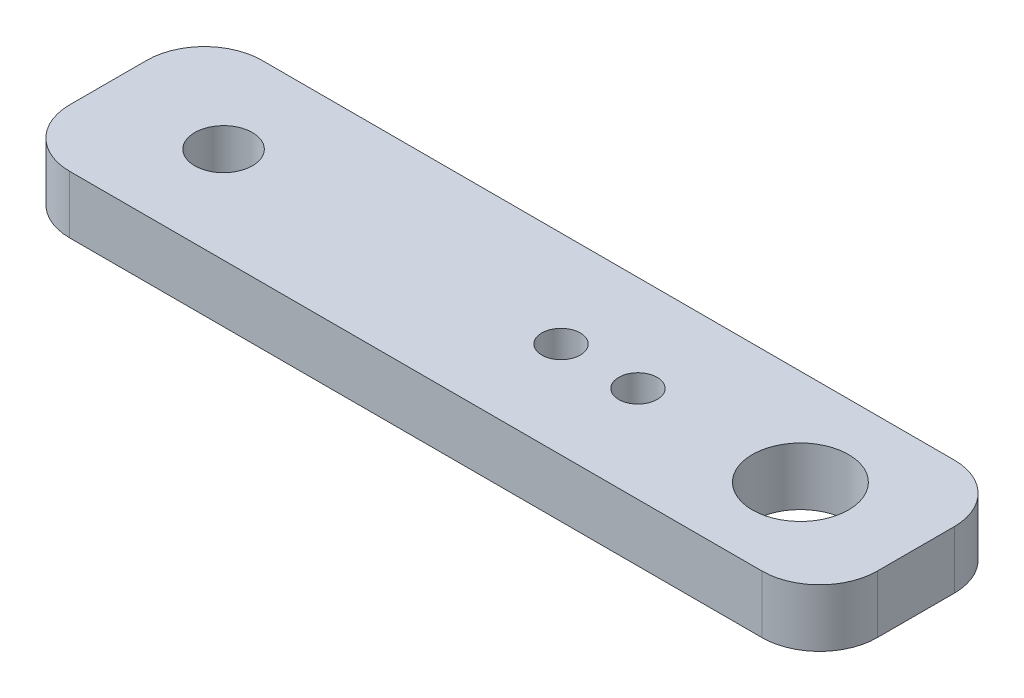
ISO-10303-21;
HEADER;
FILE_DESCRIPTION(('STEP AP214'),'2;1');
FILE_NAME('part.step','',(''),(''),'','','');
FILE_SCHEMA(('AUTOMOTIVE_DESIGN { 1 0 10303 214 1 1 1 1 }'));
ENDSEC;
DATA;
#1=APPLICATION_CONTEXT('core data for automotive mechanical design processes');
#2=APPLICATION_PROTOCOL_DEFINITION('international standard','automotive_design',2000,#1);
#3=PRODUCT_CONTEXT('',#1,'mechanical');
#4=PRODUCT('Part','Part','',(#3));
#5=PRODUCT_RELATED_PRODUCT_CATEGORY('part','',(#4));
#6=PRODUCT_DEFINITION_FORMATION('','',#4);
#7=PRODUCT_DEFINITION_CONTEXT('part definition',#1,'design');
#8=PRODUCT_DEFINITION('design','',#6,#7);
#9=PRODUCT_DEFINITION_SHAPE('','',#8);
#10=(LENGTH_UNIT() NAMED_UNIT(*) SI_UNIT(.MILLI.,.METRE.));
#11=(NAMED_UNIT(*) PLANE_ANGLE_UNIT() SI_UNIT($,.RADIAN.));
#12=(NAMED_UNIT(*) SI_UNIT($,.STERADIAN.) SOLID_ANGLE_UNIT());
#13=UNCERTAINTY_MEASURE_WITH_UNIT(LENGTH_MEASURE(1.E-05),#10,'distance_accuracy_value','');
#14=(GEOMETRIC_REPRESENTATION_CONTEXT(3) GLOBAL_UNCERTAINTY_ASSIGNED_CONTEXT((#13)) GLOBAL_UNIT_ASSIGNED_CONTEXT((#10,
#11,#12)) REPRESENTATION_CONTEXT('',''));
#15=CARTESIAN_POINT('',(0.,0.,0.));
#16=DIRECTION('',(0.,0.,1.));
#17=DIRECTION('',(1.,0.,0.));
#18=AXIS2_PLACEMENT_3D('',#15,#16,#17);
#19=CARTESIAN_POINT('',(21.,3.,-5.));
#20=DIRECTION('',(-1.,0.,0.));
#21=DIRECTION('',(0.,0.,1.));
#22=AXIS2_PLACEMENT_3D('',#19,#20,#21);
#23=PLANE('',#22);
#24=DIRECTION('',(0.,0.,-1.));
#25=VECTOR('',#24,1.);
#26=CARTESIAN_POINT('',(21.,3.,-5.));
#27=LINE('',#26,#25);
#28=CARTESIAN_POINT('',(21.,3.,2.));
#29=VERTEX_POINT('',#28);
#30=CARTESIAN_POINT('',(21.,3.,-2.));
#31=VERTEX_POINT('',#30);
#32=EDGE_CURVE('E127',#29,#31,#27,.T.);
#33=ORIENTED_EDGE('',*,*,#32,.F.);
#34=DIRECTION('',(0.,-1.,0.));
#35=VECTOR('',#34,1.);
#36=CARTESIAN_POINT('',(21.,3.,2.));
#37=LINE('',#36,#35);
#38=CARTESIAN_POINT('',(21.,0.,2.));
#39=VERTEX_POINT('',#38);
#40=EDGE_CURVE('E11',#29,#39,#37,.T.);
#41=ORIENTED_EDGE('',*,*,#40,.T.);
#42=DIRECTION('',(0.,0.,-1.));
#43=VECTOR('',#42,1.);
#44=CARTESIAN_POINT('',(21.,0.,-5.));
#45=LINE('',#44,#43);
#46=CARTESIAN_POINT('',(21.,0.,-2.));
#47=VERTEX_POINT('',#46);
#48=EDGE_CURVE('E129',#39,#47,#45,.T.);
#49=ORIENTED_EDGE('',*,*,#48,.T.);
#50=DIRECTION('',(0.,-1.,0.));
#51=VECTOR('',#50,1.);
#52=CARTESIAN_POINT('',(21.,3.,-2.));
#53=LINE('',#52,#51);
#54=EDGE_CURVE('E40',#47,#31,#53,.F.);
#55=ORIENTED_EDGE('',*,*,#54,.T.);
#56=EDGE_LOOP('',(#33,#41,#49,#55));
#57=FACE_BOUND('',#56,.T.);
#58=ADVANCED_FACE('F32',(#57),#23,.F.);
#59=CARTESIAN_POINT('',(-21.,3.,-5.));
#60=DIRECTION('',(0.,0.,1.));
#61=DIRECTION('',(1.,0.,0.));
#62=AXIS2_PLACEMENT_3D('',#59,#60,#61);
#63=PLANE('',#62);
#64=DIRECTION('',(-1.,0.,0.));
#65=VECTOR('',#64,1.);
#66=CARTESIAN_POINT('',(-21.,0.,-5.));
#67=LINE('',#66,#65);
#68=CARTESIAN_POINT('',(18.,0.,-5.));
#69=VERTEX_POINT('',#68);
#70=CARTESIAN_POINT('',(-18.,0.,-5.));
#71=VERTEX_POINT('',#70);
#72=EDGE_CURVE('E125',#69,#71,#67,.T.);
#73=ORIENTED_EDGE('',*,*,#72,.T.);
#74=DIRECTION('',(0.,-1.,0.));
#75=VECTOR('',#74,1.);
#76=CARTESIAN_POINT('',(-18.,3.,-5.));
#77=LINE('',#76,#75);
#78=CARTESIAN_POINT('',(-18.,3.,-5.));
#79=VERTEX_POINT('',#78);
#80=EDGE_CURVE('E104',#71,#79,#77,.F.);
#81=ORIENTED_EDGE('',*,*,#80,.T.);
#82=DIRECTION('',(-1.,0.,0.));
#83=VECTOR('',#82,1.);
#84=CARTESIAN_POINT('',(-21.,3.,-5.));
#85=LINE('',#84,#83);
#86=CARTESIAN_POINT('',(18.,3.,-5.));
#87=VERTEX_POINT('',#86);
#88=EDGE_CURVE('E165',#87,#79,#85,.T.);
#89=ORIENTED_EDGE('',*,*,#88,.F.);
#90=DIRECTION('',(0.,-1.,0.));
#91=VECTOR('',#90,1.);
#92=CARTESIAN_POINT('',(18.,3.,-5.));
#93=LINE('',#92,#91);
#94=EDGE_CURVE('E109',#87,#69,#93,.T.);
#95=ORIENTED_EDGE('',*,*,#94,.T.);
#96=EDGE_LOOP('',(#73,#81,#89,#95));
#97=FACE_BOUND('',#96,.T.);
#98=ADVANCED_FACE('F169',(#97),#63,.F.);
#99=CARTESIAN_POINT('',(-21.,3.,-5.));
#100=DIRECTION('',(1.,0.,0.));
#101=DIRECTION('',(0.,0.,-1.));
#102=AXIS2_PLACEMENT_3D('',#99,#100,#101);
#103=PLANE('',#102);
#104=DIRECTION('',(0.,0.,1.));
#105=VECTOR('',#104,1.);
#106=CARTESIAN_POINT('',(-21.,3.,-5.));
#107=LINE('',#106,#105);
#108=CARTESIAN_POINT('',(-21.,3.,-2.));
#109=VERTEX_POINT('',#108);
#110=CARTESIAN_POINT('',(-21.,3.,2.));
#111=VERTEX_POINT('',#110);
#112=EDGE_CURVE('E118',#109,#111,#107,.T.);
#113=ORIENTED_EDGE('',*,*,#112,.F.);
#114=DIRECTION('',(0.,-1.,0.));
#115=VECTOR('',#114,1.);
#116=CARTESIAN_POINT('',(-21.,3.,-2.));
#117=LINE('',#116,#115);
#118=CARTESIAN_POINT('',(-21.,0.,-2.));
#119=VERTEX_POINT('',#118);
#120=EDGE_CURVE('E103',#109,#119,#117,.T.);
#121=ORIENTED_EDGE('',*,*,#120,.T.);
#122=DIRECTION('',(0.,0.,1.));
#123=VECTOR('',#122,1.);
#124=CARTESIAN_POINT('',(-21.,0.,-5.));
#125=LINE('',#124,#123);
#126=CARTESIAN_POINT('',(-21.,0.,2.));
#127=VERTEX_POINT('',#126);
#128=EDGE_CURVE('E116',#119,#127,#125,.T.);
#129=ORIENTED_EDGE('',*,*,#128,.T.);
#130=DIRECTION('',(0.,-1.,0.));
#131=VECTOR('',#130,1.);
#132=CARTESIAN_POINT('',(-21.,3.,2.));
#133=LINE('',#132,#131);
#134=EDGE_CURVE('E120',#127,#111,#133,.F.);
#135=ORIENTED_EDGE('',*,*,#134,.T.);
#136=EDGE_LOOP('',(#113,#121,#129,#135));
#137=FACE_BOUND('',#136,.T.);
#138=ADVANCED_FACE('F115',(#137),#103,.F.);
#139=CARTESIAN_POINT('',(-21.,3.,5.));
#140=DIRECTION('',(0.,0.,-1.));
#141=DIRECTION('',(-1.,0.,0.));
#142=AXIS2_PLACEMENT_3D('',#139,#140,#141);
#143=PLANE('',#142);
#144=DIRECTION('',(1.,0.,0.));
#145=VECTOR('',#144,1.);
#146=CARTESIAN_POINT('',(-21.,3.,5.));
#147=LINE('',#146,#145);
#148=CARTESIAN_POINT('',(-18.,3.,5.));
#149=VERTEX_POINT('',#148);
#150=CARTESIAN_POINT('',(18.,3.,5.));
#151=VERTEX_POINT('',#150);
#152=EDGE_CURVE('E133',#149,#151,#147,.T.);
#153=ORIENTED_EDGE('',*,*,#152,.F.);
#154=DIRECTION('',(0.,-1.,0.));
#155=VECTOR('',#154,1.);
#156=CARTESIAN_POINT('',(-18.,3.,5.));
#157=LINE('',#156,#155);
#158=CARTESIAN_POINT('',(-18.,0.,5.));
#159=VERTEX_POINT('',#158);
#160=EDGE_CURVE('E150',#149,#159,#157,.T.);
#161=ORIENTED_EDGE('',*,*,#160,.T.);
#162=DIRECTION('',(1.,0.,0.));
#163=VECTOR('',#162,1.);
#164=CARTESIAN_POINT('',(-21.,0.,5.));
#165=LINE('',#164,#163);
#166=CARTESIAN_POINT('',(18.,0.,5.));
#167=VERTEX_POINT('',#166);
#168=EDGE_CURVE('E124',#159,#167,#165,.T.);
#169=ORIENTED_EDGE('',*,*,#168,.T.);
#170=DIRECTION('',(0.,-1.,0.));
#171=VECTOR('',#170,1.);
#172=CARTESIAN_POINT('',(18.,3.,5.));
#173=LINE('',#172,#171);
#174=EDGE_CURVE('E47',#167,#151,#173,.F.);
#175=ORIENTED_EDGE('',*,*,#174,.T.);
#176=EDGE_LOOP('',(#153,#161,#169,#175));
#177=FACE_BOUND('',#176,.T.);
#178=ADVANCED_FACE('F210',(#177),#143,.F.);
#179=CARTESIAN_POINT('',(0.,3.,0.));
#180=DIRECTION('',(0.,1.,0.));
#181=DIRECTION('',(0.,0.,1.));
#182=AXIS2_PLACEMENT_3D('',#179,#180,#181);
#183=PLANE('',#182);
#184=CARTESIAN_POINT('',(6.55,3.,0.));
#185=DIRECTION('',(0.,1.,0.));
#186=DIRECTION('',(0.,0.,-1.));
#187=AXIS2_PLACEMENT_3D('',#184,#185,#186);
#188=CIRCLE('',#187,1.);
#189=CARTESIAN_POINT('',(6.55,3.,-1.));
#190=VERTEX_POINT('',#189);
#191=EDGE_CURVE('E193',#190,#190,#188,.T.);
#192=ORIENTED_EDGE('',*,*,#191,.F.);
#193=EDGE_LOOP('',(#192));
#194=FACE_BOUND('',#193,.T.);
#195=CARTESIAN_POINT('',(2.55,3.,0.));
#196=DIRECTION('',(0.,1.,0.));
#197=DIRECTION('',(0.,0.,-1.));
#198=AXIS2_PLACEMENT_3D('',#195,#196,#197);
#199=CIRCLE('',#198,1.);
#200=CARTESIAN_POINT('',(2.55,3.,-1.));
#201=VERTEX_POINT('',#200);
#202=EDGE_CURVE('E187',#201,#201,#199,.T.);
#203=ORIENTED_EDGE('',*,*,#202,.F.);
#204=EDGE_LOOP('',(#203));
#205=FACE_BOUND('',#204,.T.);
#206=CARTESIAN_POINT('',(-15.,3.,0.));
#207=DIRECTION('',(0.,1.,0.));
#208=DIRECTION('',(0.,0.,1.));
#209=AXIS2_PLACEMENT_3D('',#206,#207,#208);
#210=CIRCLE('',#209,1.49999999999999);
#211=CARTESIAN_POINT('',(-15.,3.,1.49999999999999));
#212=VERTEX_POINT('',#211);
#213=EDGE_CURVE('E183',#212,#212,#210,.T.);
#214=ORIENTED_EDGE('',*,*,#213,.F.);
#215=EDGE_LOOP('',(#214));
#216=FACE_BOUND('',#215,.T.);
#217=CARTESIAN_POINT('',(15.,3.,0.));
#218=DIRECTION('',(0.,1.,0.));
#219=DIRECTION('',(0.,0.,1.));
#220=AXIS2_PLACEMENT_3D('',#217,#218,#219);
#221=CIRCLE('',#220,2.49999999999999);
#222=CARTESIAN_POINT('',(15.,3.,2.49999999999999));
#223=VERTEX_POINT('',#222);
#224=EDGE_CURVE('E172',#223,#223,#221,.T.);
#225=ORIENTED_EDGE('',*,*,#224,.F.);
#226=EDGE_LOOP('',(#225));
#227=FACE_BOUND('',#226,.T.);
#228=ORIENTED_EDGE('',*,*,#88,.T.);
#229=CARTESIAN_POINT('',(-18.,3.,-2.));
#230=DIRECTION('',(0.,1.,0.));
#231=DIRECTION('',(0.,0.,1.));
#232=AXIS2_PLACEMENT_3D('',#229,#230,#231);
#233=CIRCLE('',#232,3.);
#234=EDGE_CURVE('E147',#79,#109,#233,.T.);
#235=ORIENTED_EDGE('',*,*,#234,.T.);
#236=ORIENTED_EDGE('',*,*,#112,.T.);
#237=CARTESIAN_POINT('',(-18.,3.,2.));
#238=DIRECTION('',(0.,1.,0.));
#239=DIRECTION('',(0.,0.,1.));
#240=AXIS2_PLACEMENT_3D('',#237,#238,#239);
#241=CIRCLE('',#240,3.);
#242=EDGE_CURVE('E54',#111,#149,#241,.T.);
#243=ORIENTED_EDGE('',*,*,#242,.T.);
#244=ORIENTED_EDGE('',*,*,#152,.T.);
#245=CARTESIAN_POINT('',(18.,3.,2.));
#246=DIRECTION('',(0.,1.,0.));
#247=DIRECTION('',(0.,0.,1.));
#248=AXIS2_PLACEMENT_3D('',#245,#246,#247);
#249=CIRCLE('',#248,3.);
#250=EDGE_CURVE('E144',#151,#29,#249,.T.);
#251=ORIENTED_EDGE('',*,*,#250,.T.);
#252=ORIENTED_EDGE('',*,*,#32,.T.);
#253=CARTESIAN_POINT('',(18.,3.,-2.));
#254=DIRECTION('',(0.,1.,0.));
#255=DIRECTION('',(0.,0.,1.));
#256=AXIS2_PLACEMENT_3D('',#253,#254,#255);
#257=CIRCLE('',#256,3.);
#258=EDGE_CURVE('E142',#31,#87,#257,.T.);
#259=ORIENTED_EDGE('',*,*,#258,.T.);
#260=EDGE_LOOP('',(#228,#235,#236,#243,#244,#251,#252,#259));
#261=FACE_BOUND('',#260,.T.);
#262=ADVANCED_FACE('F162',(#194,#205,#216,#227,#261),#183,.T.);
#263=CARTESIAN_POINT('',(0.,0.,0.));
#264=DIRECTION('',(0.,1.,0.));
#265=DIRECTION('',(0.,0.,1.));
#266=AXIS2_PLACEMENT_3D('',#263,#264,#265);
#267=PLANE('',#266);
#268=CARTESIAN_POINT('',(6.55,0.,0.));
#269=DIRECTION('',(0.,1.,0.));
#270=DIRECTION('',(0.,0.,-1.));
#271=AXIS2_PLACEMENT_3D('',#268,#269,#270);
#272=CIRCLE('',#271,1.);
#273=CARTESIAN_POINT('',(6.55,0.,-1.));
#274=VERTEX_POINT('',#273);
#275=EDGE_CURVE('E186',#274,#274,#272,.T.);
#276=ORIENTED_EDGE('',*,*,#275,.T.);
#277=EDGE_LOOP('',(#276));
#278=FACE_BOUND('',#277,.T.);
#279=CARTESIAN_POINT('',(2.55,0.,0.));
#280=DIRECTION('',(0.,1.,0.));
#281=DIRECTION('',(0.,0.,-1.));
#282=AXIS2_PLACEMENT_3D('',#279,#280,#281);
#283=CIRCLE('',#282,1.);
#284=CARTESIAN_POINT('',(2.55,0.,-1.));
#285=VERTEX_POINT('',#284);
#286=EDGE_CURVE('E190',#285,#285,#283,.T.);
#287=ORIENTED_EDGE('',*,*,#286,.T.);
#288=EDGE_LOOP('',(#287));
#289=FACE_BOUND('',#288,.T.);
#290=CARTESIAN_POINT('',(-15.,0.,0.));
#291=DIRECTION('',(0.,1.,0.));
#292=DIRECTION('',(0.,0.,1.));
#293=AXIS2_PLACEMENT_3D('',#290,#291,#292);
#294=CIRCLE('',#293,1.5);
#295=CARTESIAN_POINT('',(-15.,0.,1.5));
#296=VERTEX_POINT('',#295);
#297=EDGE_CURVE('E180',#296,#296,#294,.T.);
#298=ORIENTED_EDGE('',*,*,#297,.T.);
#299=EDGE_LOOP('',(#298));
#300=FACE_BOUND('',#299,.T.);
#301=CARTESIAN_POINT('',(15.,0.,0.));
#302=DIRECTION('',(0.,1.,0.));
#303=DIRECTION('',(0.,0.,1.));
#304=AXIS2_PLACEMENT_3D('',#301,#302,#303);
#305=CIRCLE('',#304,2.5);
#306=CARTESIAN_POINT('',(15.,0.,2.5));
#307=VERTEX_POINT('',#306);
#308=EDGE_CURVE('E170',#307,#307,#305,.T.);
#309=ORIENTED_EDGE('',*,*,#308,.T.);
#310=EDGE_LOOP('',(#309));
#311=FACE_BOUND('',#310,.T.);
#312=ORIENTED_EDGE('',*,*,#128,.F.);
#313=CARTESIAN_POINT('',(-18.,0.,-2.));
#314=DIRECTION('',(0.,1.,0.));
#315=DIRECTION('',(0.,0.,1.));
#316=AXIS2_PLACEMENT_3D('',#313,#314,#315);
#317=CIRCLE('',#316,3.);
#318=EDGE_CURVE('E99',#119,#71,#317,.F.);
#319=ORIENTED_EDGE('',*,*,#318,.T.);
#320=ORIENTED_EDGE('',*,*,#72,.F.);
#321=CARTESIAN_POINT('',(18.,0.,-2.));
#322=DIRECTION('',(0.,1.,0.));
#323=DIRECTION('',(0.,0.,1.));
#324=AXIS2_PLACEMENT_3D('',#321,#322,#323);
#325=CIRCLE('',#324,3.);
#326=EDGE_CURVE('E119',#69,#47,#325,.F.);
#327=ORIENTED_EDGE('',*,*,#326,.T.);
#328=ORIENTED_EDGE('',*,*,#48,.F.);
#329=CARTESIAN_POINT('',(18.,0.,2.));
#330=DIRECTION('',(0.,1.,0.));
#331=DIRECTION('',(0.,0.,1.));
#332=AXIS2_PLACEMENT_3D('',#329,#330,#331);
#333=CIRCLE('',#332,3.);
#334=EDGE_CURVE('E136',#39,#167,#333,.F.);
#335=ORIENTED_EDGE('',*,*,#334,.T.);
#336=ORIENTED_EDGE('',*,*,#168,.F.);
#337=CARTESIAN_POINT('',(-18.,0.,2.));
#338=DIRECTION('',(0.,1.,0.));
#339=DIRECTION('',(0.,0.,1.));
#340=AXIS2_PLACEMENT_3D('',#337,#338,#339);
#341=CIRCLE('',#340,3.);
#342=EDGE_CURVE('E110',#159,#127,#341,.F.);
#343=ORIENTED_EDGE('',*,*,#342,.T.);
#344=EDGE_LOOP('',(#312,#319,#320,#327,#328,#335,#336,#343));
#345=FACE_BOUND('',#344,.T.);
#346=ADVANCED_FACE('F122',(#278,#289,#300,#311,#345),#267,.F.);
#347=CARTESIAN_POINT('',(15.,3.,0.));
#348=DIRECTION('',(0.,1.,0.));
#349=DIRECTION('',(0.,0.,1.));
#350=AXIS2_PLACEMENT_3D('',#347,#348,#349);
#351=CYLINDRICAL_SURFACE('',#350,2.5);
#352=ORIENTED_EDGE('',*,*,#308,.F.);
#353=EDGE_LOOP('',(#352));
#354=FACE_BOUND('',#353,.T.);
#355=ORIENTED_EDGE('',*,*,#224,.T.);
#356=EDGE_LOOP('',(#355));
#357=FACE_BOUND('',#356,.T.);
#358=ADVANCED_FACE('F218',(#354,#357),#351,.F.);
#359=CARTESIAN_POINT('',(-15.,3.,0.));
#360=DIRECTION('',(0.,1.,0.));
#361=DIRECTION('',(0.,0.,1.));
#362=AXIS2_PLACEMENT_3D('',#359,#360,#361);
#363=CYLINDRICAL_SURFACE('',#362,1.49999999999999);
#364=ORIENTED_EDGE('',*,*,#297,.F.);
#365=EDGE_LOOP('',(#364));
#366=FACE_BOUND('',#365,.T.);
#367=ORIENTED_EDGE('',*,*,#213,.T.);
#368=EDGE_LOOP('',(#367));
#369=FACE_BOUND('',#368,.T.);
#370=ADVANCED_FACE('F220',(#366,#369),#363,.F.);
#371=CARTESIAN_POINT('',(2.55,0.,0.));
#372=DIRECTION('',(0.,1.,0.));
#373=DIRECTION('',(0.,0.,1.));
#374=AXIS2_PLACEMENT_3D('',#371,#372,#373);
#375=CYLINDRICAL_SURFACE('',#374,1.);
#376=ORIENTED_EDGE('',*,*,#286,.F.);
#377=EDGE_LOOP('',(#376));
#378=FACE_BOUND('',#377,.T.);
#379=ORIENTED_EDGE('',*,*,#202,.T.);
#380=EDGE_LOOP('',(#379));
#381=FACE_BOUND('',#380,.T.);
#382=ADVANCED_FACE('F204',(#378,#381),#375,.F.);
#383=CARTESIAN_POINT('',(6.55,0.,0.));
#384=DIRECTION('',(0.,1.,0.));
#385=DIRECTION('',(0.,0.,1.));
#386=AXIS2_PLACEMENT_3D('',#383,#384,#385);
#387=CYLINDRICAL_SURFACE('',#386,1.);
#388=ORIENTED_EDGE('',*,*,#275,.F.);
#389=EDGE_LOOP('',(#388));
#390=FACE_BOUND('',#389,.T.);
#391=ORIENTED_EDGE('',*,*,#191,.T.);
#392=EDGE_LOOP('',(#391));
#393=FACE_BOUND('',#392,.T.);
#394=ADVANCED_FACE('F201',(#390,#393),#387,.F.);
#395=CARTESIAN_POINT('',(-18.,3.,-2.));
#396=DIRECTION('',(0.,-1.,0.));
#397=DIRECTION('',(0.,0.,-1.));
#398=AXIS2_PLACEMENT_3D('',#395,#396,#397);
#399=CYLINDRICAL_SURFACE('',#398,3.);
#400=ORIENTED_EDGE('',*,*,#234,.F.);
#401=ORIENTED_EDGE('',*,*,#80,.F.);
#402=ORIENTED_EDGE('',*,*,#318,.F.);
#403=ORIENTED_EDGE('',*,*,#120,.F.);
#404=EDGE_LOOP('',(#400,#401,#402,#403));
#405=FACE_BOUND('',#404,.T.);
#406=ADVANCED_FACE('F102',(#405),#399,.T.);
#407=CARTESIAN_POINT('',(-18.,3.,2.));
#408=DIRECTION('',(0.,-1.,0.));
#409=DIRECTION('',(0.,0.,-1.));
#410=AXIS2_PLACEMENT_3D('',#407,#408,#409);
#411=CYLINDRICAL_SURFACE('',#410,3.);
#412=ORIENTED_EDGE('',*,*,#242,.F.);
#413=ORIENTED_EDGE('',*,*,#134,.F.);
#414=ORIENTED_EDGE('',*,*,#342,.F.);
#415=ORIENTED_EDGE('',*,*,#160,.F.);
#416=EDGE_LOOP('',(#412,#413,#414,#415));
#417=FACE_BOUND('',#416,.T.);
#418=ADVANCED_FACE('F241',(#417),#411,.T.);
#419=CARTESIAN_POINT('',(18.,3.,2.));
#420=DIRECTION('',(0.,-1.,0.));
#421=DIRECTION('',(0.,0.,-1.));
#422=AXIS2_PLACEMENT_3D('',#419,#420,#421);
#423=CYLINDRICAL_SURFACE('',#422,3.);
#424=ORIENTED_EDGE('',*,*,#250,.F.);
#425=ORIENTED_EDGE('',*,*,#174,.F.);
#426=ORIENTED_EDGE('',*,*,#334,.F.);
#427=ORIENTED_EDGE('',*,*,#40,.F.);
#428=EDGE_LOOP('',(#424,#425,#426,#427));
#429=FACE_BOUND('',#428,.T.);
#430=ADVANCED_FACE('F243',(#429),#423,.T.);
#431=CARTESIAN_POINT('',(18.,3.,-2.));
#432=DIRECTION('',(0.,-1.,0.));
#433=DIRECTION('',(0.,0.,-1.));
#434=AXIS2_PLACEMENT_3D('',#431,#432,#433);
#435=CYLINDRICAL_SURFACE('',#434,3.);
#436=ORIENTED_EDGE('',*,*,#258,.F.);
#437=ORIENTED_EDGE('',*,*,#54,.F.);
#438=ORIENTED_EDGE('',*,*,#326,.F.);
#439=ORIENTED_EDGE('',*,*,#94,.F.);
#440=EDGE_LOOP('',(#436,#437,#438,#439));
#441=FACE_BOUND('',#440,.T.);
#442=ADVANCED_FACE('F34',(#441),#435,.T.);
#443=CLOSED_SHELL('',(#58,#98,#138,#178,#262,#346,#358,#370,#382,#394,#406,#418,#430,#442));
#444=MANIFOLD_SOLID_BREP('B2',#443);
#445=ADVANCED_BREP_SHAPE_REPRESENTATION('',(#18,#444),#14);
#446=SHAPE_DEFINITION_REPRESENTATION(#9,#445);
ENDSEC;
END-ISO-10303-21;
